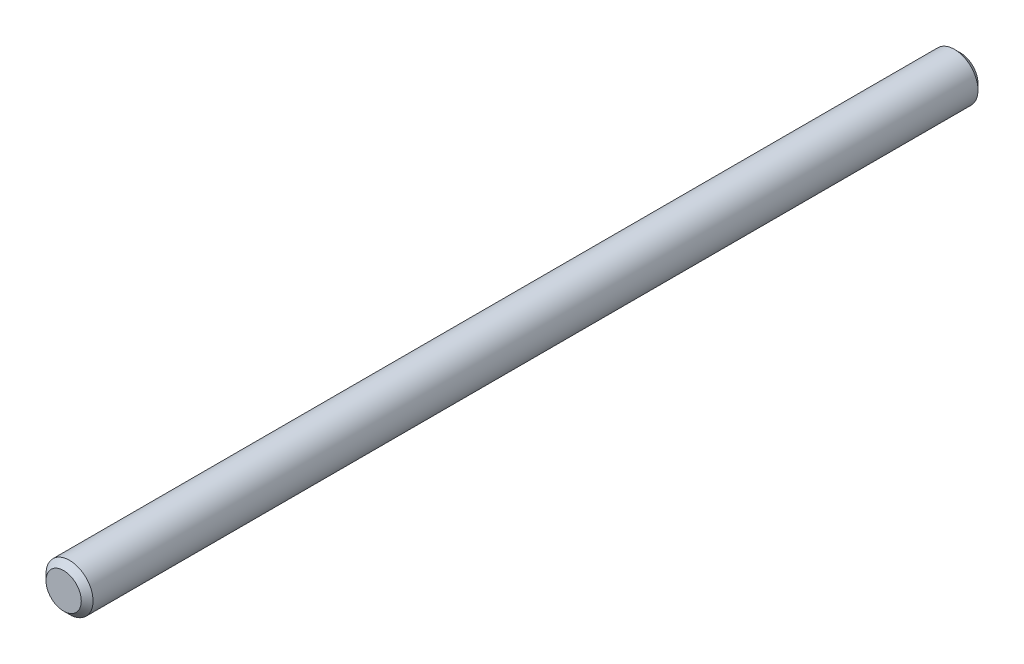
ISO-10303-21;
HEADER;
FILE_DESCRIPTION(('STEP AP214'),'2;1');
FILE_NAME('part.step','',(''),(''),'','','');
FILE_SCHEMA(('AUTOMOTIVE_DESIGN { 1 0 10303 214 1 1 1 1 }'));
ENDSEC;
DATA;
#1=APPLICATION_CONTEXT('core data for automotive mechanical design processes');
#2=APPLICATION_PROTOCOL_DEFINITION('international standard','automotive_design',2000,#1);
#3=PRODUCT_CONTEXT('',#1,'mechanical');
#4=PRODUCT('Part','Part','',(#3));
#5=PRODUCT_RELATED_PRODUCT_CATEGORY('part','',(#4));
#6=PRODUCT_DEFINITION_FORMATION('','',#4);
#7=PRODUCT_DEFINITION_CONTEXT('part definition',#1,'design');
#8=PRODUCT_DEFINITION('design','',#6,#7);
#9=PRODUCT_DEFINITION_SHAPE('','',#8);
#10=(LENGTH_UNIT() NAMED_UNIT(*) SI_UNIT(.MILLI.,.METRE.));
#11=(NAMED_UNIT(*) PLANE_ANGLE_UNIT() SI_UNIT($,.RADIAN.));
#12=(NAMED_UNIT(*) SI_UNIT($,.STERADIAN.) SOLID_ANGLE_UNIT());
#13=UNCERTAINTY_MEASURE_WITH_UNIT(LENGTH_MEASURE(1.E-05),#10,'distance_accuracy_value','');
#14=(GEOMETRIC_REPRESENTATION_CONTEXT(3) GLOBAL_UNCERTAINTY_ASSIGNED_CONTEXT((#13)) GLOBAL_UNIT_ASSIGNED_CONTEXT((#10,
#11,#12)) REPRESENTATION_CONTEXT('',''));
#15=CARTESIAN_POINT('',(0.,0.,0.));
#16=DIRECTION('',(0.,0.,1.));
#17=DIRECTION('',(1.,0.,0.));
#18=AXIS2_PLACEMENT_3D('',#15,#16,#17);
#19=CARTESIAN_POINT('',(0.,0.,0.396240000034951));
#20=DIRECTION('',(0.,0.,1.));
#21=DIRECTION('',(1.,0.,0.));
#22=AXIS2_PLACEMENT_3D('',#19,#20,#21);
#23=CONICAL_SURFACE('',#22,1.5824200000125,0.785398163397448);
#24=CARTESIAN_POINT('',(0.,0.,3.02510500768323E-11));
#25=DIRECTION('',(0.,0.,1.));
#26=DIRECTION('',(1.,0.,0.));
#27=AXIS2_PLACEMENT_3D('',#24,#25,#26);
#28=CIRCLE('',#27,1.1861800000078);
#29=CARTESIAN_POINT('',(1.18618000000779,0.,3.02509051087305E-11));
#30=VERTEX_POINT('',#29);
#31=EDGE_CURVE('E44',#30,#30,#28,.T.);
#32=ORIENTED_EDGE('',*,*,#31,.T.);
#33=EDGE_LOOP('',(#32));
#34=FACE_BOUND('',#33,.T.);
#35=CARTESIAN_POINT('',(0.,0.,0.396240000034951));
#36=DIRECTION('',(0.,0.,1.));
#37=DIRECTION('',(1.,0.,0.));
#38=AXIS2_PLACEMENT_3D('',#35,#36,#37);
#39=CIRCLE('',#38,1.5824200000125);
#40=CARTESIAN_POINT('',(1.58242000001249,0.,0.396240000034951));
#41=VERTEX_POINT('',#40);
#42=EDGE_CURVE('E10',#41,#41,#39,.T.);
#43=ORIENTED_EDGE('',*,*,#42,.F.);
#44=EDGE_LOOP('',(#43));
#45=FACE_BOUND('',#44,.T.);
#46=ADVANCED_FACE('F30',(#34,#45),#23,.T.);
#47=CARTESIAN_POINT('',(0.,0.,3.02510503738845E-11));
#48=DIRECTION('',(0.,0.,1.));
#49=DIRECTION('',(1.,0.,0.));
#50=AXIS2_PLACEMENT_3D('',#47,#48,#49);
#51=CYLINDRICAL_SURFACE('',#50,1.58242000001249);
#52=ORIENTED_EDGE('',*,*,#42,.T.);
#53=EDGE_LOOP('',(#52));
#54=FACE_BOUND('',#53,.T.);
#55=CARTESIAN_POINT('',(0.,0.,59.9287600000349));
#56=DIRECTION('',(0.,0.,1.));
#57=DIRECTION('',(1.,0.,0.));
#58=AXIS2_PLACEMENT_3D('',#55,#56,#57);
#59=CIRCLE('',#58,1.58242000001249);
#60=CARTESIAN_POINT('',(1.58242000001249,0.,59.9287600000349));
#61=VERTEX_POINT('',#60);
#62=EDGE_CURVE('E36',#61,#61,#59,.T.);
#63=ORIENTED_EDGE('',*,*,#62,.F.);
#64=EDGE_LOOP('',(#63));
#65=FACE_BOUND('',#64,.T.);
#66=ADVANCED_FACE('F63',(#54,#65),#51,.T.);
#67=CARTESIAN_POINT('',(0.,0.,60.325));
#68=DIRECTION('',(0.,0.,-1.));
#69=DIRECTION('',(-1.,0.,0.));
#70=AXIS2_PLACEMENT_3D('',#67,#68,#69);
#71=CONICAL_SURFACE('',#70,1.18618000004744,0.785398163397449);
#72=ORIENTED_EDGE('',*,*,#62,.T.);
#73=EDGE_LOOP('',(#72));
#74=FACE_BOUND('',#73,.T.);
#75=CARTESIAN_POINT('',(0.,0.,60.325));
#76=DIRECTION('',(0.,0.,1.));
#77=DIRECTION('',(1.,0.,0.));
#78=AXIS2_PLACEMENT_3D('',#75,#76,#77);
#79=CIRCLE('',#78,1.18618000004744);
#80=CARTESIAN_POINT('',(1.18618000004744,0.,60.325));
#81=VERTEX_POINT('',#80);
#82=EDGE_CURVE('E40',#81,#81,#79,.T.);
#83=ORIENTED_EDGE('',*,*,#82,.F.);
#84=EDGE_LOOP('',(#83));
#85=FACE_BOUND('',#84,.T.);
#86=ADVANCED_FACE('F59',(#74,#85),#71,.T.);
#87=CARTESIAN_POINT('',(0.,0.,60.325));
#88=DIRECTION('',(0.,0.,1.));
#89=DIRECTION('',(1.,0.,0.));
#90=AXIS2_PLACEMENT_3D('',#87,#88,#89);
#91=PLANE('',#90);
#92=ORIENTED_EDGE('',*,*,#82,.T.);
#93=EDGE_LOOP('',(#92));
#94=FACE_BOUND('',#93,.T.);
#95=ADVANCED_FACE('F54',(#94),#91,.T.);
#96=CARTESIAN_POINT('',(1.18618000000779,0.,3.02509052572566E-11));
#97=DIRECTION('',(0.,0.,-1.));
#98=DIRECTION('',(-1.,0.,0.));
#99=AXIS2_PLACEMENT_3D('',#96,#97,#98);
#100=PLANE('',#99);
#101=ORIENTED_EDGE('',*,*,#31,.F.);
#102=EDGE_LOOP('',(#101));
#103=FACE_BOUND('',#102,.T.);
#104=ADVANCED_FACE('F52',(#103),#100,.T.);
#105=CLOSED_SHELL('',(#46,#66,#86,#95,#104));
#106=MANIFOLD_SOLID_BREP('B2',#105);
#107=ADVANCED_BREP_SHAPE_REPRESENTATION('',(#18,#106),#14);
#108=SHAPE_DEFINITION_REPRESENTATION(#9,#107);
ENDSEC;
END-ISO-10303-21;
